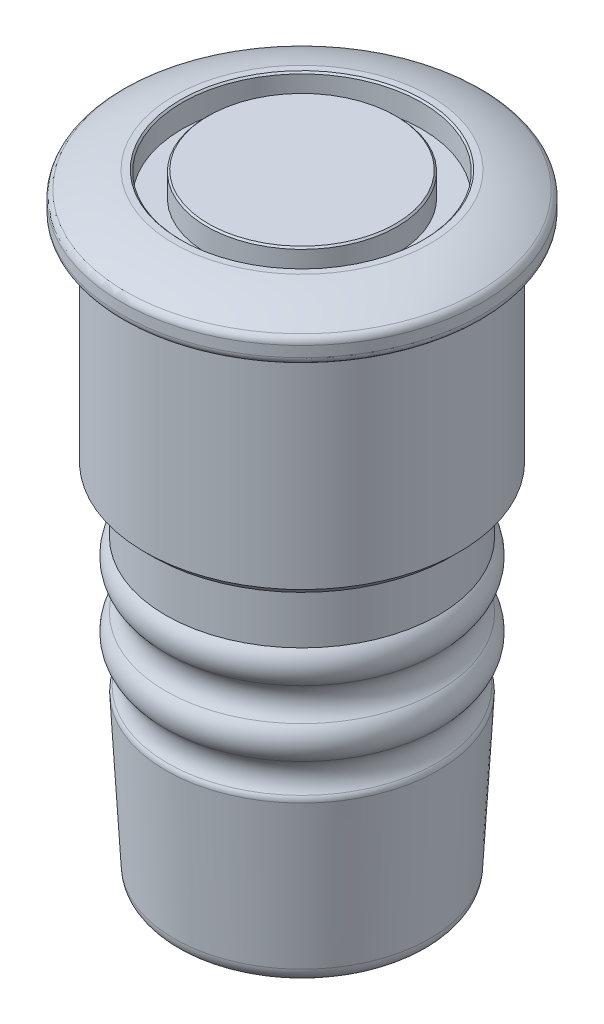
ISO-10303-21;
HEADER;
FILE_DESCRIPTION(('STEP AP214'),'2;1');
FILE_NAME('part.step','',(''),(''),'','','');
FILE_SCHEMA(('AUTOMOTIVE_DESIGN { 1 0 10303 214 1 1 1 1 }'));
ENDSEC;
DATA;
#1=APPLICATION_CONTEXT('core data for automotive mechanical design processes');
#2=APPLICATION_PROTOCOL_DEFINITION('international standard','automotive_design',2000,#1);
#3=PRODUCT_CONTEXT('',#1,'mechanical');
#4=PRODUCT('Part','Part','',(#3));
#5=PRODUCT_RELATED_PRODUCT_CATEGORY('part','',(#4));
#6=PRODUCT_DEFINITION_FORMATION('','',#4);
#7=PRODUCT_DEFINITION_CONTEXT('part definition',#1,'design');
#8=PRODUCT_DEFINITION('design','',#6,#7);
#9=PRODUCT_DEFINITION_SHAPE('','',#8);
#10=(LENGTH_UNIT() NAMED_UNIT(*) SI_UNIT(.MILLI.,.METRE.));
#11=(NAMED_UNIT(*) PLANE_ANGLE_UNIT() SI_UNIT($,.RADIAN.));
#12=(NAMED_UNIT(*) SI_UNIT($,.STERADIAN.) SOLID_ANGLE_UNIT());
#13=UNCERTAINTY_MEASURE_WITH_UNIT(LENGTH_MEASURE(1.E-05),#10,'distance_accuracy_value','');
#14=(GEOMETRIC_REPRESENTATION_CONTEXT(3) GLOBAL_UNCERTAINTY_ASSIGNED_CONTEXT((#13)) GLOBAL_UNIT_ASSIGNED_CONTEXT((#10,
#11,#12)) REPRESENTATION_CONTEXT('',''));
#15=CARTESIAN_POINT('',(0.,0.,0.));
#16=DIRECTION('',(0.,0.,1.));
#17=DIRECTION('',(1.,0.,0.));
#18=AXIS2_PLACEMENT_3D('',#15,#16,#17);
#19=CARTESIAN_POINT('',(0.,-37.6462835964407,0.));
#20=DIRECTION('',(0.,1.,0.));
#21=DIRECTION('',(-1.,0.,0.));
#22=AXIS2_PLACEMENT_3D('',#19,#20,#21);
#23=PLANE('',#22);
#24=CARTESIAN_POINT('',(0.,-37.6462835964407,0.));
#25=DIRECTION('',(0.,1.,0.));
#26=DIRECTION('',(1.,0.,0.));
#27=AXIS2_PLACEMENT_3D('',#24,#25,#26);
#28=CIRCLE('',#27,6.79541833565989);
#29=CARTESIAN_POINT('',(6.7954183356599,-37.6462835964407,0.));
#30=VERTEX_POINT('',#29);
#31=CARTESIAN_POINT('',(-6.79541833565989,-37.6462835964407,0.));
#32=VERTEX_POINT('',#31);
#33=EDGE_CURVE('E48',#30,#32,#28,.T.);
#34=ORIENTED_EDGE('',*,*,#33,.F.);
#35=CARTESIAN_POINT('',(0.,-37.6462835964407,0.));
#36=DIRECTION('',(0.,1.,0.));
#37=DIRECTION('',(-1.,0.,0.));
#38=AXIS2_PLACEMENT_3D('',#35,#36,#37);
#39=CIRCLE('',#38,6.79541833565989);
#40=EDGE_CURVE('E45',#32,#30,#39,.T.);
#41=ORIENTED_EDGE('',*,*,#40,.F.);
#42=EDGE_LOOP('',(#34,#41));
#43=FACE_BOUND('',#42,.T.);
#44=ADVANCED_FACE('F17',(#43),#23,.F.);
#45=CARTESIAN_POINT('',(0.,-36.6462835964407,0.));
#46=DIRECTION('',(0.,1.,0.));
#47=DIRECTION('',(-1.,0.,0.));
#48=AXIS2_PLACEMENT_3D('',#45,#46,#47);
#49=TOROIDAL_SURFACE('',#48,6.7954183356599,1.);
#50=CARTESIAN_POINT('',(0.,-36.7009728738613,0.));
#51=DIRECTION('',(0.,1.,0.));
#52=DIRECTION('',(-1.,0.,0.));
#53=AXIS2_PLACEMENT_3D('',#50,#51,#52);
#54=CIRCLE('',#53,7.79392175725404);
#55=CARTESIAN_POINT('',(-7.79392175725404,-36.7009728738614,0.));
#56=VERTEX_POINT('',#55);
#57=EDGE_CURVE('E55',#56,#56,#54,.T.);
#58=ORIENTED_EDGE('',*,*,#57,.F.);
#59=EDGE_LOOP('',(#58));
#60=FACE_BOUND('',#59,.T.);
#61=ORIENTED_EDGE('',*,*,#40,.T.);
#62=ORIENTED_EDGE('',*,*,#33,.T.);
#63=EDGE_LOOP('',(#61,#62));
#64=FACE_BOUND('',#63,.T.);
#65=ADVANCED_FACE('F54',(#60,#64),#49,.T.);
#66=CARTESIAN_POINT('',(0.,0.,0.));
#67=DIRECTION('',(0.,-1.,0.));
#68=DIRECTION('',(1.,0.,0.));
#69=AXIS2_PLACEMENT_3D('',#66,#67,#68);
#70=PLANE('',#69);
#71=CARTESIAN_POINT('',(0.,5.684255149907E-11,0.));
#72=DIRECTION('',(0.,-1.,0.));
#73=DIRECTION('',(1.,0.,0.));
#74=AXIS2_PLACEMENT_3D('',#71,#72,#73);
#75=CIRCLE('',#74,5.70482267943362);
#76=CARTESIAN_POINT('',(5.70482267943362,5.68432507495638E-11,0.));
#77=VERTEX_POINT('',#76);
#78=EDGE_CURVE('E79',#77,#77,#75,.T.);
#79=ORIENTED_EDGE('',*,*,#78,.F.);
#80=EDGE_LOOP('',(#79));
#81=FACE_BOUND('',#80,.T.);
#82=ADVANCED_FACE('F71',(#81),#70,.F.);
#83=CARTESIAN_POINT('',(0.,-27.5763986849219,0.));
#84=DIRECTION('',(0.,1.,0.));
#85=DIRECTION('',(0.,0.,1.));
#86=AXIS2_PLACEMENT_3D('',#83,#84,#85);
#87=CONICAL_SURFACE('',#86,8.29368606288564,0.0547165760269755);
#88=CARTESIAN_POINT('',(0.,-27.5763986849219,0.));
#89=DIRECTION('',(0.,1.,0.));
#90=DIRECTION('',(-1.,0.,0.));
#91=AXIS2_PLACEMENT_3D('',#88,#89,#90);
#92=CIRCLE('',#91,8.29368606288564);
#93=CARTESIAN_POINT('',(-8.29368606288563,-27.5763986849219,0.));
#94=VERTEX_POINT('',#93);
#95=EDGE_CURVE('E80',#94,#94,#92,.T.);
#96=ORIENTED_EDGE('',*,*,#95,.F.);
#97=EDGE_LOOP('',(#96));
#98=FACE_BOUND('',#97,.T.);
#99=ORIENTED_EDGE('',*,*,#57,.T.);
#100=EDGE_LOOP('',(#99));
#101=FACE_BOUND('',#100,.T.);
#102=ADVANCED_FACE('F100',(#98,#101),#87,.T.);
#103=CARTESIAN_POINT('',(0.,-0.0999999999748987,0.));
#104=DIRECTION('',(0.,-1.,0.));
#105=DIRECTION('',(1.,0.,0.));
#106=AXIS2_PLACEMENT_3D('',#103,#104,#105);
#107=CONICAL_SURFACE('',#106,5.80482267940851,0.785398163113231);
#108=CARTESIAN_POINT('',(0.,-0.0999999999999994,0.));
#109=DIRECTION('',(0.,1.,0.));
#110=DIRECTION('',(-1.,0.,0.));
#111=AXIS2_PLACEMENT_3D('',#108,#109,#110);
#112=CIRCLE('',#111,5.80482267939647);
#113=CARTESIAN_POINT('',(-5.80482267939647,-0.1,0.));
#114=VERTEX_POINT('',#113);
#115=EDGE_CURVE('E83',#114,#114,#112,.F.);
#116=ORIENTED_EDGE('',*,*,#115,.F.);
#117=EDGE_LOOP('',(#116));
#118=FACE_BOUND('',#117,.T.);
#119=ORIENTED_EDGE('',*,*,#78,.T.);
#120=EDGE_LOOP('',(#119));
#121=FACE_BOUND('',#120,.T.);
#122=ADVANCED_FACE('F96',(#118,#121),#107,.T.);
#123=CARTESIAN_POINT('',(0.,-27.5490540462116,0.));
#124=DIRECTION('',(0.,1.,0.));
#125=DIRECTION('',(-1.,0.,0.));
#126=AXIS2_PLACEMENT_3D('',#123,#124,#125);
#127=TOROIDAL_SURFACE('',#126,7.79443435208857,0.499999999999999);
#128=CARTESIAN_POINT('',(0.,-27.2418822136559,0.));
#129=DIRECTION('',(0.,1.,0.));
#130=DIRECTION('',(-1.,0.,0.));
#131=AXIS2_PLACEMENT_3D('',#128,#129,#130);
#132=CIRCLE('',#131,8.1889536358814);
#133=CARTESIAN_POINT('',(-8.1889536358814,-27.2418822136559,0.));
#134=VERTEX_POINT('',#133);
#135=EDGE_CURVE('E86',#134,#134,#132,.F.);
#136=ORIENTED_EDGE('',*,*,#135,.T.);
#137=EDGE_LOOP('',(#136));
#138=FACE_BOUND('',#137,.T.);
#139=ORIENTED_EDGE('',*,*,#95,.T.);
#140=EDGE_LOOP('',(#139));
#141=FACE_BOUND('',#140,.T.);
#142=ADVANCED_FACE('F91',(#138,#141),#127,.T.);
#143=CARTESIAN_POINT('',(0.,13.266832438197,0.));
#144=DIRECTION('',(0.,1.,0.));
#145=DIRECTION('',(-1.,0.,0.));
#146=AXIS2_PLACEMENT_3D('',#143,#144,#145);
#147=CYLINDRICAL_SURFACE('',#146,5.80482267939647);
#148=ORIENTED_EDGE('',*,*,#115,.T.);
#149=EDGE_LOOP('',(#148));
#150=FACE_BOUND('',#149,.T.);
#151=CARTESIAN_POINT('',(0.,-1.5,0.));
#152=DIRECTION('',(0.,1.,0.));
#153=DIRECTION('',(-1.,0.,0.));
#154=AXIS2_PLACEMENT_3D('',#151,#152,#153);
#155=CIRCLE('',#154,5.80482267939647);
#156=CARTESIAN_POINT('',(-5.80482267939647,-1.5,0.));
#157=VERTEX_POINT('',#156);
#158=EDGE_CURVE('E169',#157,#157,#155,.T.);
#159=ORIENTED_EDGE('',*,*,#158,.T.);
#160=EDGE_LOOP('',(#159));
#161=FACE_BOUND('',#160,.T.);
#162=ADVANCED_FACE('F95',(#150,#161),#147,.T.);
#163=CARTESIAN_POINT('',(7.30482267939647,-1.5,0.));
#164=DIRECTION('',(0.,-1.,0.));
#165=DIRECTION('',(1.,0.,0.));
#166=AXIS2_PLACEMENT_3D('',#163,#164,#165);
#167=PLANE('',#166);
#168=CARTESIAN_POINT('',(0.,-1.5,0.));
#169=DIRECTION('',(0.,1.,0.));
#170=DIRECTION('',(-1.,0.,0.));
#171=AXIS2_PLACEMENT_3D('',#168,#169,#170);
#172=CIRCLE('',#171,7.30482267939647);
#173=CARTESIAN_POINT('',(-7.30482267939647,-1.5,0.));
#174=VERTEX_POINT('',#173);
#175=EDGE_CURVE('E172',#174,#174,#172,.T.);
#176=ORIENTED_EDGE('',*,*,#175,.T.);
#177=EDGE_LOOP('',(#176));
#178=FACE_BOUND('',#177,.T.);
#179=ORIENTED_EDGE('',*,*,#158,.F.);
#180=EDGE_LOOP('',(#179));
#181=FACE_BOUND('',#180,.T.);
#182=ADVANCED_FACE('F253',(#178,#181),#167,.F.);
#183=CARTESIAN_POINT('',(0.,-26.3730690704976,0.));
#184=DIRECTION('',(0.,1.,0.));
#185=DIRECTION('',(-1.,0.,0.));
#186=AXIS2_PLACEMENT_3D('',#183,#184,#185);
#187=TOROIDAL_SURFACE('',#186,9.30482267939651,1.4142135623731);
#188=ORIENTED_EDGE('',*,*,#135,.F.);
#189=EDGE_LOOP('',(#188));
#190=FACE_BOUND('',#189,.T.);
#191=CARTESIAN_POINT('',(0.,-25.3730690704976,0.));
#192=DIRECTION('',(0.,1.,0.));
#193=DIRECTION('',(-1.,0.,0.));
#194=AXIS2_PLACEMENT_3D('',#191,#192,#193);
#195=CIRCLE('',#194,8.3048226793965);
#196=CARTESIAN_POINT('',(-8.30482267939649,-25.3730690704976,0.));
#197=VERTEX_POINT('',#196);
#198=EDGE_CURVE('E175',#197,#197,#195,.T.);
#199=ORIENTED_EDGE('',*,*,#198,.F.);
#200=EDGE_LOOP('',(#199));
#201=FACE_BOUND('',#200,.T.);
#202=ADVANCED_FACE('F251',(#190,#201),#187,.F.);
#203=CARTESIAN_POINT('',(0.,13.266832438197,0.));
#204=DIRECTION('',(0.,1.,0.));
#205=DIRECTION('',(-1.,0.,0.));
#206=AXIS2_PLACEMENT_3D('',#203,#204,#205);
#207=CYLINDRICAL_SURFACE('',#206,7.30482267939647);
#208=ORIENTED_EDGE('',*,*,#175,.F.);
#209=EDGE_LOOP('',(#208));
#210=FACE_BOUND('',#209,.T.);
#211=CARTESIAN_POINT('',(0.,-0.100000000000002,0.));
#212=DIRECTION('',(0.,1.,0.));
#213=DIRECTION('',(-1.,0.,0.));
#214=AXIS2_PLACEMENT_3D('',#211,#212,#213);
#215=CIRCLE('',#214,7.30482267939648);
#216=CARTESIAN_POINT('',(-7.30482267939647,-0.100000000000003,0.));
#217=VERTEX_POINT('',#216);
#218=EDGE_CURVE('E246',#217,#217,#215,.T.);
#219=ORIENTED_EDGE('',*,*,#218,.T.);
#220=EDGE_LOOP('',(#219));
#221=FACE_BOUND('',#220,.T.);
#222=ADVANCED_FACE('F241',(#210,#221),#207,.F.);
#223=CARTESIAN_POINT('',(0.,-24.3730690704976,0.));
#224=DIRECTION('',(0.,1.,0.));
#225=DIRECTION('',(-1.,0.,0.));
#226=AXIS2_PLACEMENT_3D('',#223,#224,#225);
#227=TOROIDAL_SURFACE('',#226,7.30482267939647,1.41421356237311);
#228=CARTESIAN_POINT('',(0.,-23.3730690704976,0.));
#229=DIRECTION('',(0.,1.,0.));
#230=DIRECTION('',(-1.,0.,0.));
#231=AXIS2_PLACEMENT_3D('',#228,#229,#230);
#232=CIRCLE('',#231,8.3048226793965);
#233=CARTESIAN_POINT('',(-8.30482267939649,-23.3730690704976,0.));
#234=VERTEX_POINT('',#233);
#235=EDGE_CURVE('E180',#234,#234,#232,.F.);
#236=ORIENTED_EDGE('',*,*,#235,.T.);
#237=EDGE_LOOP('',(#236));
#238=FACE_BOUND('',#237,.T.);
#239=ORIENTED_EDGE('',*,*,#198,.T.);
#240=EDGE_LOOP('',(#239));
#241=FACE_BOUND('',#240,.T.);
#242=ADVANCED_FACE('F237',(#238,#241),#227,.T.);
#243=CARTESIAN_POINT('',(0.,0.,0.));
#244=DIRECTION('',(0.,1.,0.));
#245=DIRECTION('',(-1.,0.,0.));
#246=AXIS2_PLACEMENT_3D('',#243,#244,#245);
#247=CONICAL_SURFACE('',#246,7.40482267939648,0.785398163397453);
#248=ORIENTED_EDGE('',*,*,#218,.F.);
#249=EDGE_LOOP('',(#248));
#250=FACE_BOUND('',#249,.T.);
#251=CARTESIAN_POINT('',(0.,0.,0.));
#252=DIRECTION('',(0.,1.,0.));
#253=DIRECTION('',(-1.,0.,0.));
#254=AXIS2_PLACEMENT_3D('',#251,#252,#253);
#255=CIRCLE('',#254,7.40482267939648);
#256=CARTESIAN_POINT('',(-7.40482267939648,0.,0.));
#257=VERTEX_POINT('',#256);
#258=EDGE_CURVE('E176',#257,#257,#255,.T.);
#259=ORIENTED_EDGE('',*,*,#258,.T.);
#260=EDGE_LOOP('',(#259));
#261=FACE_BOUND('',#260,.T.);
#262=ADVANCED_FACE('F233',(#250,#261),#247,.F.);
#263=CARTESIAN_POINT('',(7.40482267939648,0.,0.));
#264=DIRECTION('',(0.,-1.,0.));
#265=DIRECTION('',(1.,0.,0.));
#266=AXIS2_PLACEMENT_3D('',#263,#264,#265);
#267=PLANE('',#266);
#268=CARTESIAN_POINT('',(0.,0.,0.));
#269=DIRECTION('',(0.,1.,0.));
#270=DIRECTION('',(-1.,0.,0.));
#271=AXIS2_PLACEMENT_3D('',#268,#269,#270);
#272=CIRCLE('',#271,7.80482267939646);
#273=CARTESIAN_POINT('',(-7.80482267939646,0.,0.));
#274=VERTEX_POINT('',#273);
#275=EDGE_CURVE('E179',#274,#274,#272,.F.);
#276=ORIENTED_EDGE('',*,*,#275,.F.);
#277=EDGE_LOOP('',(#276));
#278=FACE_BOUND('',#277,.T.);
#279=ORIENTED_EDGE('',*,*,#258,.F.);
#280=EDGE_LOOP('',(#279));
#281=FACE_BOUND('',#280,.T.);
#282=ADVANCED_FACE('F229',(#278,#281),#267,.F.);
#283=CARTESIAN_POINT('',(0.,-22.3730690704976,0.));
#284=DIRECTION('',(0.,1.,0.));
#285=DIRECTION('',(-1.,0.,0.));
#286=AXIS2_PLACEMENT_3D('',#283,#284,#285);
#287=TOROIDAL_SURFACE('',#286,9.30482267939651,1.41421356237311);
#288=ORIENTED_EDGE('',*,*,#235,.F.);
#289=EDGE_LOOP('',(#288));
#290=FACE_BOUND('',#289,.T.);
#291=CARTESIAN_POINT('',(0.,-21.3730690704976,0.));
#292=DIRECTION('',(0.,1.,0.));
#293=DIRECTION('',(-1.,0.,0.));
#294=AXIS2_PLACEMENT_3D('',#291,#292,#293);
#295=CIRCLE('',#294,8.3048226793965);
#296=CARTESIAN_POINT('',(-8.30482267939649,-21.3730690704976,0.));
#297=VERTEX_POINT('',#296);
#298=EDGE_CURVE('E183',#297,#297,#295,.T.);
#299=ORIENTED_EDGE('',*,*,#298,.F.);
#300=EDGE_LOOP('',(#299));
#301=FACE_BOUND('',#300,.T.);
#302=ADVANCED_FACE('F226',(#290,#301),#287,.F.);
#303=CARTESIAN_POINT('',(-6.01215072474979,-9.54698432263386,0.));
#304=DIRECTION('',(0.,0.,1.));
#305=DIRECTION('',(-1.,0.,0.));
#306=AXIS2_PLACEMENT_3D('',#303,#304,#305);
#307=CIRCLE('',#306,9.71383458751452);
#308=TRIMMED_CURVE('',#307,(PARAMETER_VALUE(-2.2381717002658)),
(PARAMETER_VALUE(2.2381717002658)),.T.,.PARAMETER.);
#309=CARTESIAN_POINT('',(0.,-9.54698432263386,0.));
#310=DIRECTION('',(0.,1.,0.));
#311=AXIS1_PLACEMENT('',#309,#310);
#312=SURFACE_OF_REVOLUTION('',#308,#311);
#313=ORIENTED_EDGE('',*,*,#275,.T.);
#314=EDGE_LOOP('',(#313));
#315=FACE_BOUND('',#314,.T.);
#316=CARTESIAN_POINT('',(0.,-1.06332055637627,0.));
#317=DIRECTION('',(0.,1.,0.));
#318=DIRECTION('',(-1.,0.,0.));
#319=AXIS2_PLACEMENT_3D('',#316,#317,#318);
#320=CIRCLE('',#319,10.7435386283867);
#321=CARTESIAN_POINT('',(-10.7435386283867,-1.06332055637627,0.));
#322=VERTEX_POINT('',#321);
#323=EDGE_CURVE('E217',#322,#322,#320,.F.);
#324=ORIENTED_EDGE('',*,*,#323,.F.);
#325=EDGE_LOOP('',(#324));
#326=FACE_BOUND('',#325,.T.);
#327=ADVANCED_FACE('F211',(#315,#326),#312,.F.);
#328=CARTESIAN_POINT('',(0.,-20.3730690704976,0.));
#329=DIRECTION('',(0.,1.,0.));
#330=DIRECTION('',(-1.,0.,0.));
#331=AXIS2_PLACEMENT_3D('',#328,#329,#330);
#332=TOROIDAL_SURFACE('',#331,7.30482267939647,1.41421356237311);
#333=CARTESIAN_POINT('',(0.,-19.3730690704976,0.));
#334=DIRECTION('',(0.,1.,0.));
#335=DIRECTION('',(-1.,0.,0.));
#336=AXIS2_PLACEMENT_3D('',#333,#334,#335);
#337=CIRCLE('',#336,8.3048226793965);
#338=CARTESIAN_POINT('',(-8.30482267939649,-19.3730690704976,0.));
#339=VERTEX_POINT('',#338);
#340=EDGE_CURVE('E197',#339,#339,#337,.T.);
#341=ORIENTED_EDGE('',*,*,#340,.F.);
#342=EDGE_LOOP('',(#341));
#343=FACE_BOUND('',#342,.T.);
#344=ORIENTED_EDGE('',*,*,#298,.T.);
#345=EDGE_LOOP('',(#344));
#346=FACE_BOUND('',#345,.T.);
#347=ADVANCED_FACE('F207',(#343,#346),#332,.T.);
#348=CARTESIAN_POINT('',(0.,-1.5,0.));
#349=DIRECTION('',(0.,1.,0.));
#350=DIRECTION('',(-1.,0.,0.));
#351=AXIS2_PLACEMENT_3D('',#348,#349,#350);
#352=TOROIDAL_SURFACE('',#351,10.5,0.5);
#353=ORIENTED_EDGE('',*,*,#323,.T.);
#354=EDGE_LOOP('',(#353));
#355=FACE_BOUND('',#354,.T.);
#356=CARTESIAN_POINT('',(0.,-1.5,0.));
#357=DIRECTION('',(0.,1.,0.));
#358=DIRECTION('',(-1.,0.,0.));
#359=AXIS2_PLACEMENT_3D('',#356,#357,#358);
#360=CIRCLE('',#359,11.);
#361=CARTESIAN_POINT('',(-11.,-1.5,0.));
#362=VERTEX_POINT('',#361);
#363=EDGE_CURVE('E187',#362,#362,#360,.F.);
#364=ORIENTED_EDGE('',*,*,#363,.F.);
#365=EDGE_LOOP('',(#364));
#366=FACE_BOUND('',#365,.T.);
#367=ADVANCED_FACE('F202',(#355,#366),#352,.T.);
#368=CARTESIAN_POINT('',(0.,13.266832438197,0.));
#369=DIRECTION('',(0.,1.,0.));
#370=DIRECTION('',(-1.,0.,0.));
#371=AXIS2_PLACEMENT_3D('',#368,#369,#370);
#372=CYLINDRICAL_SURFACE('',#371,8.3048226793965);
#373=CARTESIAN_POINT('',(0.,-15.8782215082821,0.));
#374=DIRECTION('',(0.,1.,0.));
#375=DIRECTION('',(-1.,0.,0.));
#376=AXIS2_PLACEMENT_3D('',#373,#374,#375);
#377=CIRCLE('',#376,8.3048226793965);
#378=CARTESIAN_POINT('',(-8.30482267939649,-15.8782215082821,0.));
#379=VERTEX_POINT('',#378);
#380=EDGE_CURVE('E184',#379,#379,#377,.F.);
#381=ORIENTED_EDGE('',*,*,#380,.T.);
#382=EDGE_LOOP('',(#381));
#383=FACE_BOUND('',#382,.T.);
#384=ORIENTED_EDGE('',*,*,#340,.T.);
#385=EDGE_LOOP('',(#384));
#386=FACE_BOUND('',#385,.T.);
#387=ADVANCED_FACE('F206',(#383,#386),#372,.T.);
#388=CARTESIAN_POINT('',(0.,13.266832438197,0.));
#389=DIRECTION('',(0.,1.,0.));
#390=DIRECTION('',(-1.,0.,0.));
#391=AXIS2_PLACEMENT_3D('',#388,#389,#390);
#392=CYLINDRICAL_SURFACE('',#391,11.);
#393=ORIENTED_EDGE('',*,*,#363,.T.);
#394=EDGE_LOOP('',(#393));
#395=FACE_BOUND('',#394,.T.);
#396=CARTESIAN_POINT('',(0.,-2.14628359644075,0.));
#397=DIRECTION('',(0.,1.,0.));
#398=DIRECTION('',(-1.,0.,0.));
#399=AXIS2_PLACEMENT_3D('',#396,#397,#398);
#400=CIRCLE('',#399,11.);
#401=CARTESIAN_POINT('',(-11.,-2.14628359644075,0.));
#402=VERTEX_POINT('',#401);
#403=EDGE_CURVE('E186',#402,#402,#400,.F.);
#404=ORIENTED_EDGE('',*,*,#403,.F.);
#405=EDGE_LOOP('',(#404));
#406=FACE_BOUND('',#405,.T.);
#407=ADVANCED_FACE('F317',(#395,#406),#392,.T.);
#408=CARTESIAN_POINT('',(9.1,-15.8782215082821,0.));
#409=DIRECTION('',(0.,1.,0.));
#410=DIRECTION('',(-1.,0.,0.));
#411=AXIS2_PLACEMENT_3D('',#408,#409,#410);
#412=PLANE('',#411);
#413=ORIENTED_EDGE('',*,*,#380,.F.);
#414=EDGE_LOOP('',(#413));
#415=FACE_BOUND('',#414,.T.);
#416=CARTESIAN_POINT('',(0.,-15.8782215082821,0.));
#417=DIRECTION('',(0.,1.,0.));
#418=DIRECTION('',(-1.,0.,0.));
#419=AXIS2_PLACEMENT_3D('',#416,#417,#418);
#420=CIRCLE('',#419,9.1);
#421=CARTESIAN_POINT('',(-9.09999999999999,-15.8782215082821,0.));
#422=VERTEX_POINT('',#421);
#423=EDGE_CURVE('E188',#422,#422,#420,.T.);
#424=ORIENTED_EDGE('',*,*,#423,.F.);
#425=EDGE_LOOP('',(#424));
#426=FACE_BOUND('',#425,.T.);
#427=ADVANCED_FACE('F151',(#415,#426),#412,.F.);
#428=CARTESIAN_POINT('',(0.,-2.14628359644075,0.));
#429=DIRECTION('',(0.,1.,0.));
#430=DIRECTION('',(-1.,0.,0.));
#431=AXIS2_PLACEMENT_3D('',#428,#429,#430);
#432=TOROIDAL_SURFACE('',#431,10.5,0.5);
#433=ORIENTED_EDGE('',*,*,#403,.T.);
#434=EDGE_LOOP('',(#433));
#435=FACE_BOUND('',#434,.T.);
#436=CARTESIAN_POINT('',(0.,-2.64628359644075,0.));
#437=DIRECTION('',(0.,1.,0.));
#438=DIRECTION('',(-1.,0.,0.));
#439=AXIS2_PLACEMENT_3D('',#436,#437,#438);
#440=CIRCLE('',#439,10.5);
#441=CARTESIAN_POINT('',(-10.5,-2.64628359644075,0.));
#442=VERTEX_POINT('',#441);
#443=CARTESIAN_POINT('',(10.5,-2.64628359644074,0.));
#444=VERTEX_POINT('',#443);
#445=EDGE_CURVE('E143',#442,#444,#440,.T.);
#446=ORIENTED_EDGE('',*,*,#445,.T.);
#447=CARTESIAN_POINT('',(0.,-2.64628359644075,0.));
#448=DIRECTION('',(0.,1.,0.));
#449=DIRECTION('',(1.,0.,0.));
#450=AXIS2_PLACEMENT_3D('',#447,#448,#449);
#451=CIRCLE('',#450,10.5);
#452=EDGE_CURVE('E36',#444,#442,#451,.T.);
#453=ORIENTED_EDGE('',*,*,#452,.T.);
#454=EDGE_LOOP('',(#446,#453));
#455=FACE_BOUND('',#454,.T.);
#456=ADVANCED_FACE('F147',(#435,#455),#432,.T.);
#457=CARTESIAN_POINT('',(0.,-15.3782215082821,0.));
#458=DIRECTION('',(0.,1.,0.));
#459=DIRECTION('',(-1.,0.,0.));
#460=AXIS2_PLACEMENT_3D('',#457,#458,#459);
#461=CONICAL_SURFACE('',#460,9.6,0.785398163397447);
#462=ORIENTED_EDGE('',*,*,#423,.T.);
#463=EDGE_LOOP('',(#462));
#464=FACE_BOUND('',#463,.T.);
#465=CARTESIAN_POINT('',(0.,-15.3782215082821,0.));
#466=DIRECTION('',(0.,1.,0.));
#467=DIRECTION('',(-1.,0.,0.));
#468=AXIS2_PLACEMENT_3D('',#465,#466,#467);
#469=CIRCLE('',#468,9.6);
#470=CARTESIAN_POINT('',(-9.6,-15.3782215082821,0.));
#471=VERTEX_POINT('',#470);
#472=EDGE_CURVE('E28',#471,#471,#469,.T.);
#473=ORIENTED_EDGE('',*,*,#472,.F.);
#474=EDGE_LOOP('',(#473));
#475=FACE_BOUND('',#474,.T.);
#476=ADVANCED_FACE('F119',(#464,#475),#461,.T.);
#477=CARTESIAN_POINT('',(10.5,-2.64628359644074,0.));
#478=DIRECTION('',(0.,1.,0.));
#479=DIRECTION('',(-1.,0.,0.));
#480=AXIS2_PLACEMENT_3D('',#477,#478,#479);
#481=PLANE('',#480);
#482=CARTESIAN_POINT('',(0.,-2.64628359644074,0.));
#483=DIRECTION('',(0.,1.,0.));
#484=DIRECTION('',(-1.,0.,0.));
#485=AXIS2_PLACEMENT_3D('',#482,#483,#484);
#486=CIRCLE('',#485,9.6);
#487=CARTESIAN_POINT('',(-9.6,-2.64628359644074,0.));
#488=VERTEX_POINT('',#487);
#489=EDGE_CURVE('E11',#488,#488,#486,.F.);
#490=ORIENTED_EDGE('',*,*,#489,.F.);
#491=EDGE_LOOP('',(#490));
#492=FACE_BOUND('',#491,.T.);
#493=ORIENTED_EDGE('',*,*,#452,.F.);
#494=ORIENTED_EDGE('',*,*,#445,.F.);
#495=EDGE_LOOP('',(#493,#494));
#496=FACE_BOUND('',#495,.T.);
#497=ADVANCED_FACE('F113',(#492,#496),#481,.F.);
#498=CARTESIAN_POINT('',(0.,13.266832438197,0.));
#499=DIRECTION('',(0.,1.,0.));
#500=DIRECTION('',(-1.,0.,0.));
#501=AXIS2_PLACEMENT_3D('',#498,#499,#500);
#502=CYLINDRICAL_SURFACE('',#501,9.6);
#503=ORIENTED_EDGE('',*,*,#472,.T.);
#504=EDGE_LOOP('',(#503));
#505=FACE_BOUND('',#504,.T.);
#506=ORIENTED_EDGE('',*,*,#489,.T.);
#507=EDGE_LOOP('',(#506));
#508=FACE_BOUND('',#507,.T.);
#509=ADVANCED_FACE('F111',(#505,#508),#502,.T.);
#510=CLOSED_SHELL('',(#44,#65,#82,#102,#122,#142,#162,#182,#202,#222,#242,#262,#282,#302,#327,
#347,#367,#387,#407,#427,#456,#476,#497,#509));
#511=MANIFOLD_SOLID_BREP('B1',#510);
#512=ADVANCED_BREP_SHAPE_REPRESENTATION('',(#18,#511),#14);
#513=SHAPE_DEFINITION_REPRESENTATION(#9,#512);
ENDSEC;
END-ISO-10303-21;
